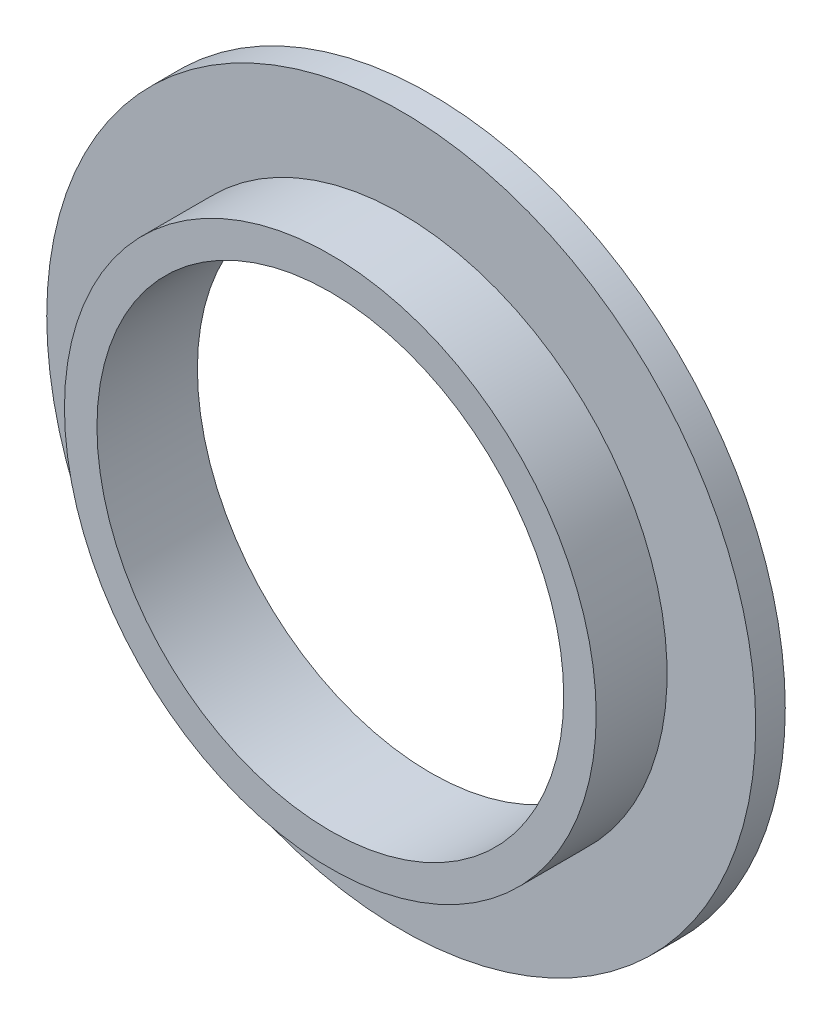
ISO-10303-21;
HEADER;
FILE_DESCRIPTION(('STEP AP214'),'2;1');
FILE_NAME('part.step','',(''),(''),'','','');
FILE_SCHEMA(('AUTOMOTIVE_DESIGN { 1 0 10303 214 1 1 1 1 }'));
ENDSEC;
DATA;
#1=APPLICATION_CONTEXT('core data for automotive mechanical design processes');
#2=APPLICATION_PROTOCOL_DEFINITION('international standard','automotive_design',2000,#1);
#3=PRODUCT_CONTEXT('',#1,'mechanical');
#4=PRODUCT('Part','Part','',(#3));
#5=PRODUCT_RELATED_PRODUCT_CATEGORY('part','',(#4));
#6=PRODUCT_DEFINITION_FORMATION('','',#4);
#7=PRODUCT_DEFINITION_CONTEXT('part definition',#1,'design');
#8=PRODUCT_DEFINITION('design','',#6,#7);
#9=PRODUCT_DEFINITION_SHAPE('','',#8);
#10=(LENGTH_UNIT() NAMED_UNIT(*) SI_UNIT(.MILLI.,.METRE.));
#11=(NAMED_UNIT(*) PLANE_ANGLE_UNIT() SI_UNIT($,.RADIAN.));
#12=(NAMED_UNIT(*) SI_UNIT($,.STERADIAN.) SOLID_ANGLE_UNIT());
#13=UNCERTAINTY_MEASURE_WITH_UNIT(LENGTH_MEASURE(1.E-05),#10,'distance_accuracy_value','');
#14=(GEOMETRIC_REPRESENTATION_CONTEXT(3) GLOBAL_UNCERTAINTY_ASSIGNED_CONTEXT((#13)) GLOBAL_UNIT_ASSIGNED_CONTEXT((#10,
#11,#12)) REPRESENTATION_CONTEXT('',''));
#15=CARTESIAN_POINT('',(0.,0.,0.));
#16=DIRECTION('',(0.,0.,1.));
#17=DIRECTION('',(1.,0.,0.));
#18=AXIS2_PLACEMENT_3D('',#15,#16,#17);
#19=CARTESIAN_POINT('',(0.,0.,10.795));
#20=DIRECTION('',(0.,0.,-1.));
#21=DIRECTION('',(-1.,0.,0.));
#22=AXIS2_PLACEMENT_3D('',#19,#20,#21);
#23=CYLINDRICAL_SURFACE('',#22,28.575);
#24=CARTESIAN_POINT('',(0.,0.,10.795));
#25=DIRECTION('',(0.,0.,1.));
#26=DIRECTION('',(1.,0.,0.));
#27=AXIS2_PLACEMENT_3D('',#24,#25,#26);
#28=CIRCLE('',#27,28.575);
#29=CARTESIAN_POINT('',(28.575,0.,10.795));
#30=VERTEX_POINT('',#29);
#31=EDGE_CURVE('E37',#30,#30,#28,.T.);
#32=ORIENTED_EDGE('',*,*,#31,.F.);
#33=EDGE_LOOP('',(#32));
#34=FACE_BOUND('',#33,.T.);
#35=CARTESIAN_POINT('',(0.,0.,3.175));
#36=DIRECTION('',(0.,0.,-1.));
#37=DIRECTION('',(-1.,0.,0.));
#38=AXIS2_PLACEMENT_3D('',#35,#36,#37);
#39=CIRCLE('',#38,28.575);
#40=CARTESIAN_POINT('',(-28.575,0.,3.175));
#41=VERTEX_POINT('',#40);
#42=EDGE_CURVE('E10',#41,#41,#39,.T.);
#43=ORIENTED_EDGE('',*,*,#42,.F.);
#44=EDGE_LOOP('',(#43));
#45=FACE_BOUND('',#44,.T.);
#46=ADVANCED_FACE('F31',(#34,#45),#23,.T.);
#47=CARTESIAN_POINT('',(0.,0.,10.795));
#48=DIRECTION('',(0.,0.,1.));
#49=DIRECTION('',(1.,0.,0.));
#50=AXIS2_PLACEMENT_3D('',#47,#48,#49);
#51=PLANE('',#50);
#52=ORIENTED_EDGE('',*,*,#31,.T.);
#53=EDGE_LOOP('',(#52));
#54=FACE_BOUND('',#53,.T.);
#55=CARTESIAN_POINT('',(0.,0.,10.795));
#56=DIRECTION('',(0.,0.,1.));
#57=DIRECTION('',(1.,0.,0.));
#58=AXIS2_PLACEMENT_3D('',#55,#56,#57);
#59=CIRCLE('',#58,25.0825);
#60=CARTESIAN_POINT('',(25.0825,0.,10.795));
#61=VERTEX_POINT('',#60);
#62=EDGE_CURVE('E41',#61,#61,#59,.T.);
#63=ORIENTED_EDGE('',*,*,#62,.F.);
#64=EDGE_LOOP('',(#63));
#65=FACE_BOUND('',#64,.T.);
#66=ADVANCED_FACE('F69',(#54,#65),#51,.T.);
#67=CARTESIAN_POINT('',(0.,0.,0.));
#68=DIRECTION('',(0.,0.,1.));
#69=DIRECTION('',(1.,0.,0.));
#70=AXIS2_PLACEMENT_3D('',#67,#68,#69);
#71=PLANE('',#70);
#72=CARTESIAN_POINT('',(0.,0.,0.));
#73=DIRECTION('',(0.,0.,1.));
#74=DIRECTION('',(1.,0.,0.));
#75=AXIS2_PLACEMENT_3D('',#72,#73,#74);
#76=CIRCLE('',#75,25.0825);
#77=CARTESIAN_POINT('',(25.0825,0.,0.));
#78=VERTEX_POINT('',#77);
#79=EDGE_CURVE('E45',#78,#78,#76,.T.);
#80=ORIENTED_EDGE('',*,*,#79,.T.);
#81=EDGE_LOOP('',(#80));
#82=FACE_BOUND('',#81,.T.);
#83=CARTESIAN_POINT('',(0.,0.,0.));
#84=DIRECTION('',(0.,0.,-1.));
#85=DIRECTION('',(-1.,0.,0.));
#86=AXIS2_PLACEMENT_3D('',#83,#84,#85);
#87=CIRCLE('',#86,38.1);
#88=CARTESIAN_POINT('',(-38.1,0.,0.));
#89=VERTEX_POINT('',#88);
#90=EDGE_CURVE('E51',#89,#89,#87,.T.);
#91=ORIENTED_EDGE('',*,*,#90,.T.);
#92=EDGE_LOOP('',(#91));
#93=FACE_BOUND('',#92,.T.);
#94=ADVANCED_FACE('F76',(#82,#93),#71,.F.);
#95=CARTESIAN_POINT('',(0.,0.,10.795));
#96=DIRECTION('',(0.,0.,-1.));
#97=DIRECTION('',(-1.,0.,0.));
#98=AXIS2_PLACEMENT_3D('',#95,#96,#97);
#99=CYLINDRICAL_SURFACE('',#98,25.0825);
#100=ORIENTED_EDGE('',*,*,#62,.T.);
#101=EDGE_LOOP('',(#100));
#102=FACE_BOUND('',#101,.T.);
#103=ORIENTED_EDGE('',*,*,#79,.F.);
#104=EDGE_LOOP('',(#103));
#105=FACE_BOUND('',#104,.T.);
#106=ADVANCED_FACE('F66',(#102,#105),#99,.F.);
#107=CARTESIAN_POINT('',(0.,0.,3.175));
#108=DIRECTION('',(0.,0.,-1.));
#109=DIRECTION('',(-1.,0.,0.));
#110=AXIS2_PLACEMENT_3D('',#107,#108,#109);
#111=CYLINDRICAL_SURFACE('',#110,38.1);
#112=CARTESIAN_POINT('',(0.,0.,3.175));
#113=DIRECTION('',(0.,0.,-1.));
#114=DIRECTION('',(-1.,0.,0.));
#115=AXIS2_PLACEMENT_3D('',#112,#113,#114);
#116=CIRCLE('',#115,38.1);
#117=CARTESIAN_POINT('',(-38.1,0.,3.175));
#118=VERTEX_POINT('',#117);
#119=EDGE_CURVE('E49',#118,#118,#116,.T.);
#120=ORIENTED_EDGE('',*,*,#119,.T.);
#121=EDGE_LOOP('',(#120));
#122=FACE_BOUND('',#121,.T.);
#123=ORIENTED_EDGE('',*,*,#90,.F.);
#124=EDGE_LOOP('',(#123));
#125=FACE_BOUND('',#124,.T.);
#126=ADVANCED_FACE('F57',(#122,#125),#111,.T.);
#127=CARTESIAN_POINT('',(0.,0.,3.175));
#128=DIRECTION('',(0.,0.,-1.));
#129=DIRECTION('',(-1.,0.,0.));
#130=AXIS2_PLACEMENT_3D('',#127,#128,#129);
#131=PLANE('',#130);
#132=ORIENTED_EDGE('',*,*,#42,.T.);
#133=EDGE_LOOP('',(#132));
#134=FACE_BOUND('',#133,.T.);
#135=ORIENTED_EDGE('',*,*,#119,.F.);
#136=EDGE_LOOP('',(#135));
#137=FACE_BOUND('',#136,.T.);
#138=ADVANCED_FACE('F60',(#134,#137),#131,.F.);
#139=CLOSED_SHELL('',(#46,#66,#94,#106,#126,#138));
#140=MANIFOLD_SOLID_BREP('B2',#139);
#141=ADVANCED_BREP_SHAPE_REPRESENTATION('',(#18,#140),#14);
#142=SHAPE_DEFINITION_REPRESENTATION(#9,#141);
ENDSEC;
END-ISO-10303-21;
